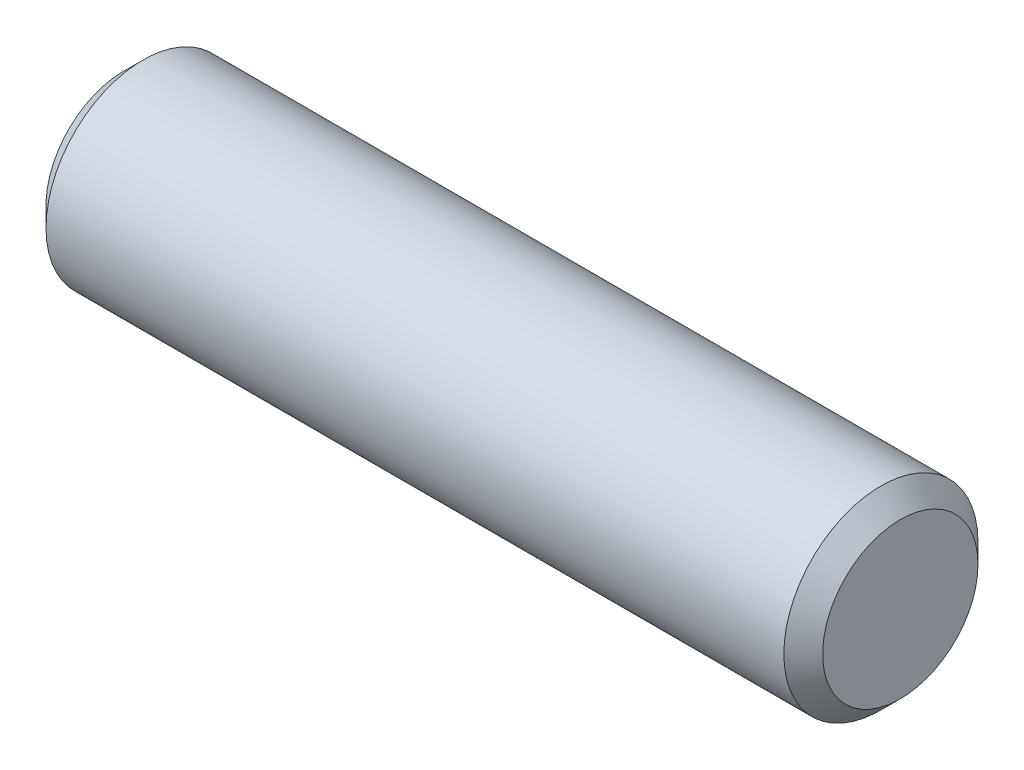
ISO-10303-21;
HEADER;
FILE_DESCRIPTION(('STEP AP214'),'2;1');
FILE_NAME('part.step','',(''),(''),'','','');
FILE_SCHEMA(('AUTOMOTIVE_DESIGN { 1 0 10303 214 1 1 1 1 }'));
ENDSEC;
DATA;
#1=APPLICATION_CONTEXT('core data for automotive mechanical design processes');
#2=APPLICATION_PROTOCOL_DEFINITION('international standard','automotive_design',2000,#1);
#3=PRODUCT_CONTEXT('',#1,'mechanical');
#4=PRODUCT('Part','Part','',(#3));
#5=PRODUCT_RELATED_PRODUCT_CATEGORY('part','',(#4));
#6=PRODUCT_DEFINITION_FORMATION('','',#4);
#7=PRODUCT_DEFINITION_CONTEXT('part definition',#1,'design');
#8=PRODUCT_DEFINITION('design','',#6,#7);
#9=PRODUCT_DEFINITION_SHAPE('','',#8);
#10=(LENGTH_UNIT() NAMED_UNIT(*) SI_UNIT(.MILLI.,.METRE.));
#11=(NAMED_UNIT(*) PLANE_ANGLE_UNIT() SI_UNIT($,.RADIAN.));
#12=(NAMED_UNIT(*) SI_UNIT($,.STERADIAN.) SOLID_ANGLE_UNIT());
#13=UNCERTAINTY_MEASURE_WITH_UNIT(LENGTH_MEASURE(1.E-05),#10,'distance_accuracy_value','');
#14=(GEOMETRIC_REPRESENTATION_CONTEXT(3) GLOBAL_UNCERTAINTY_ASSIGNED_CONTEXT((#13)) GLOBAL_UNIT_ASSIGNED_CONTEXT((#10,
#11,#12)) REPRESENTATION_CONTEXT('',''));
#15=CARTESIAN_POINT('',(0.,0.,0.));
#16=DIRECTION('',(0.,0.,1.));
#17=DIRECTION('',(1.,0.,0.));
#18=AXIS2_PLACEMENT_3D('',#15,#16,#17);
#19=CARTESIAN_POINT('',(-12.7,0.,0.));
#20=DIRECTION('',(1.,0.,0.));
#21=DIRECTION('',(0.,0.,-1.));
#22=AXIS2_PLACEMENT_3D('',#19,#20,#21);
#23=CYLINDRICAL_SURFACE('',#22,3.175);
#24=CARTESIAN_POINT('',(12.065,0.,0.));
#25=DIRECTION('',(1.,0.,0.));
#26=DIRECTION('',(0.,0.,-1.));
#27=AXIS2_PLACEMENT_3D('',#24,#25,#26);
#28=CIRCLE('',#27,3.175);
#29=CARTESIAN_POINT('',(12.065,0.,-3.175));
#30=VERTEX_POINT('',#29);
#31=EDGE_CURVE('E37',#30,#30,#28,.F.);
#32=ORIENTED_EDGE('',*,*,#31,.T.);
#33=EDGE_LOOP('',(#32));
#34=FACE_BOUND('',#33,.T.);
#35=CARTESIAN_POINT('',(-12.065,0.,0.));
#36=DIRECTION('',(1.,0.,0.));
#37=DIRECTION('',(0.,0.,-1.));
#38=AXIS2_PLACEMENT_3D('',#35,#36,#37);
#39=CIRCLE('',#38,3.175);
#40=CARTESIAN_POINT('',(-12.065,0.,-3.175));
#41=VERTEX_POINT('',#40);
#42=EDGE_CURVE('E41',#41,#41,#39,.T.);
#43=ORIENTED_EDGE('',*,*,#42,.T.);
#44=EDGE_LOOP('',(#43));
#45=FACE_BOUND('',#44,.T.);
#46=ADVANCED_FACE('F30',(#34,#45),#23,.T.);
#47=CARTESIAN_POINT('',(-12.7,0.,0.));
#48=DIRECTION('',(1.,0.,0.));
#49=DIRECTION('',(0.,0.,-1.));
#50=AXIS2_PLACEMENT_3D('',#47,#48,#49);
#51=PLANE('',#50);
#52=CARTESIAN_POINT('',(-12.7,0.,0.));
#53=DIRECTION('',(1.,0.,0.));
#54=DIRECTION('',(0.,0.,-1.));
#55=AXIS2_PLACEMENT_3D('',#52,#53,#54);
#56=CIRCLE('',#55,2.54);
#57=CARTESIAN_POINT('',(-12.7,0.,-2.54));
#58=VERTEX_POINT('',#57);
#59=EDGE_CURVE('E10',#58,#58,#56,.F.);
#60=ORIENTED_EDGE('',*,*,#59,.T.);
#61=EDGE_LOOP('',(#60));
#62=FACE_BOUND('',#61,.T.);
#63=ADVANCED_FACE('F61',(#62),#51,.F.);
#64=CARTESIAN_POINT('',(12.7,0.,0.));
#65=DIRECTION('',(1.,0.,0.));
#66=DIRECTION('',(0.,0.,-1.));
#67=AXIS2_PLACEMENT_3D('',#64,#65,#66);
#68=PLANE('',#67);
#69=CARTESIAN_POINT('',(12.7,0.,0.));
#70=DIRECTION('',(1.,0.,0.));
#71=DIRECTION('',(0.,0.,-1.));
#72=AXIS2_PLACEMENT_3D('',#69,#70,#71);
#73=CIRCLE('',#72,2.54);
#74=CARTESIAN_POINT('',(12.7,0.,-2.54));
#75=VERTEX_POINT('',#74);
#76=EDGE_CURVE('E45',#75,#75,#73,.T.);
#77=ORIENTED_EDGE('',*,*,#76,.T.);
#78=EDGE_LOOP('',(#77));
#79=FACE_BOUND('',#78,.T.);
#80=ADVANCED_FACE('F51',(#79),#68,.T.);
#81=CARTESIAN_POINT('',(12.7,0.,0.));
#82=DIRECTION('',(-1.,0.,0.));
#83=DIRECTION('',(0.,0.,1.));
#84=AXIS2_PLACEMENT_3D('',#81,#82,#83);
#85=CONICAL_SURFACE('',#84,2.54,0.785398163397445);
#86=ORIENTED_EDGE('',*,*,#31,.F.);
#87=EDGE_LOOP('',(#86));
#88=FACE_BOUND('',#87,.T.);
#89=ORIENTED_EDGE('',*,*,#76,.F.);
#90=EDGE_LOOP('',(#89));
#91=FACE_BOUND('',#90,.T.);
#92=ADVANCED_FACE('F53',(#88,#91),#85,.T.);
#93=CARTESIAN_POINT('',(-12.065,0.,0.));
#94=DIRECTION('',(1.,0.,0.));
#95=DIRECTION('',(0.,0.,-1.));
#96=AXIS2_PLACEMENT_3D('',#93,#94,#95);
#97=CONICAL_SURFACE('',#96,3.175,0.785398163397448);
#98=ORIENTED_EDGE('',*,*,#59,.F.);
#99=EDGE_LOOP('',(#98));
#100=FACE_BOUND('',#99,.T.);
#101=ORIENTED_EDGE('',*,*,#42,.F.);
#102=EDGE_LOOP('',(#101));
#103=FACE_BOUND('',#102,.T.);
#104=ADVANCED_FACE('F32',(#100,#103),#97,.T.);
#105=CLOSED_SHELL('',(#46,#63,#80,#92,#104));
#106=MANIFOLD_SOLID_BREP('B2',#105);
#107=ADVANCED_BREP_SHAPE_REPRESENTATION('',(#18,#106),#14);
#108=SHAPE_DEFINITION_REPRESENTATION(#9,#107);
ENDSEC;
END-ISO-10303-21;
